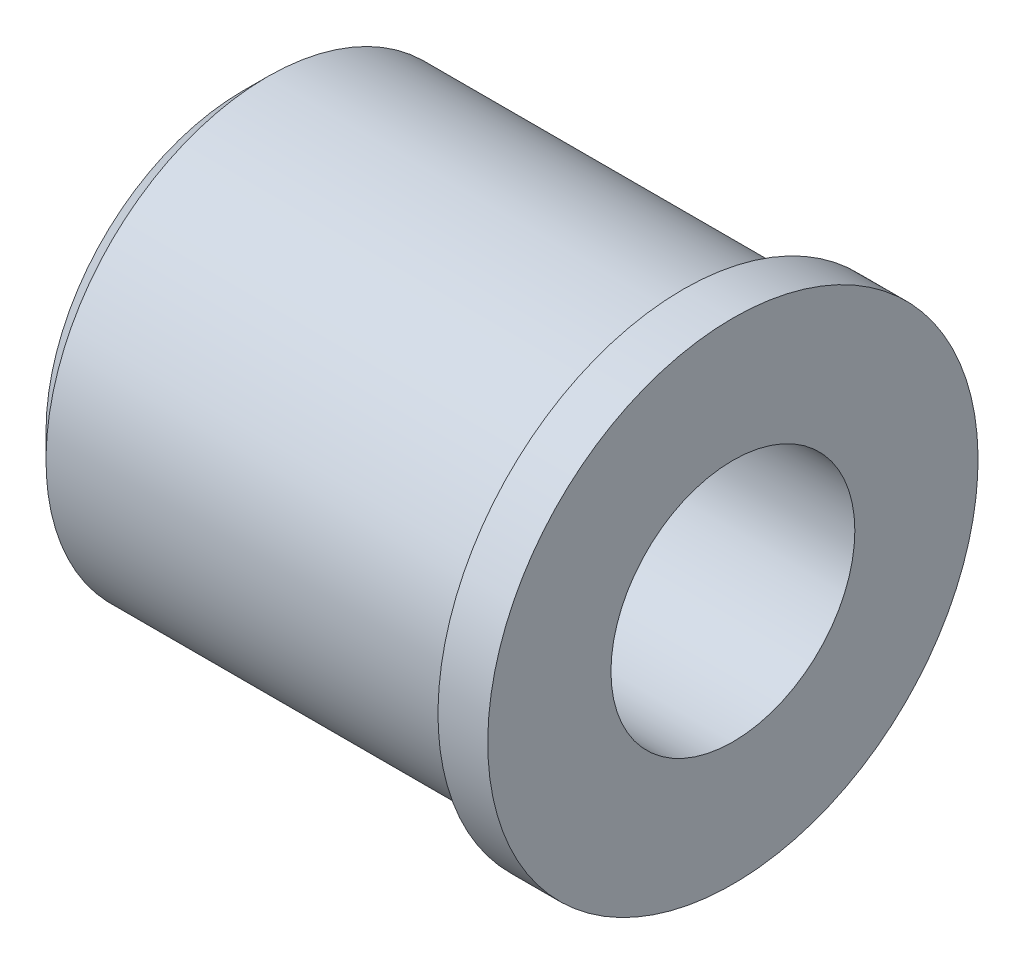
ISO-10303-21;
HEADER;
FILE_DESCRIPTION(('STEP AP214'),'2;1');
FILE_NAME('part.step','',(''),(''),'','','');
FILE_SCHEMA(('AUTOMOTIVE_DESIGN { 1 0 10303 214 1 1 1 1 }'));
ENDSEC;
DATA;
#1=APPLICATION_CONTEXT('core data for automotive mechanical design processes');
#2=APPLICATION_PROTOCOL_DEFINITION('international standard','automotive_design',2000,#1);
#3=PRODUCT_CONTEXT('',#1,'mechanical');
#4=PRODUCT('Part','Part','',(#3));
#5=PRODUCT_RELATED_PRODUCT_CATEGORY('part','',(#4));
#6=PRODUCT_DEFINITION_FORMATION('','',#4);
#7=PRODUCT_DEFINITION_CONTEXT('part definition',#1,'design');
#8=PRODUCT_DEFINITION('design','',#6,#7);
#9=PRODUCT_DEFINITION_SHAPE('','',#8);
#10=(LENGTH_UNIT() NAMED_UNIT(*) SI_UNIT(.MILLI.,.METRE.));
#11=(NAMED_UNIT(*) PLANE_ANGLE_UNIT() SI_UNIT($,.RADIAN.));
#12=(NAMED_UNIT(*) SI_UNIT($,.STERADIAN.) SOLID_ANGLE_UNIT());
#13=UNCERTAINTY_MEASURE_WITH_UNIT(LENGTH_MEASURE(1.E-05),#10,'distance_accuracy_value','');
#14=(GEOMETRIC_REPRESENTATION_CONTEXT(3) GLOBAL_UNCERTAINTY_ASSIGNED_CONTEXT((#13)) GLOBAL_UNIT_ASSIGNED_CONTEXT((#10,
#11,#12)) REPRESENTATION_CONTEXT('',''));
#15=CARTESIAN_POINT('',(0.,0.,0.));
#16=DIRECTION('',(0.,0.,1.));
#17=DIRECTION('',(1.,0.,0.));
#18=AXIS2_PLACEMENT_3D('',#15,#16,#17);
#19=CARTESIAN_POINT('',(0.,-5.64560135623729,0.));
#20=DIRECTION('',(-1.,0.,0.));
#21=DIRECTION('',(0.,-1.,0.));
#22=AXIS2_PLACEMENT_3D('',#19,#20,#21);
#23=PLANE('',#22);
#24=CARTESIAN_POINT('',(0.,0.,0.));
#25=DIRECTION('',(1.,0.,0.));
#26=DIRECTION('',(0.,0.,-1.));
#27=AXIS2_PLACEMENT_3D('',#24,#25,#26);
#28=CIRCLE('',#27,1.2446);
#29=CARTESIAN_POINT('',(0.,0.,-1.2446));
#30=VERTEX_POINT('',#29);
#31=EDGE_CURVE('E46',#30,#30,#28,.T.);
#32=ORIENTED_EDGE('',*,*,#31,.F.);
#33=EDGE_LOOP('',(#32));
#34=FACE_BOUND('',#33,.T.);
#35=CARTESIAN_POINT('',(0.,0.,0.));
#36=DIRECTION('',(1.,0.,0.));
#37=DIRECTION('',(0.,1.,0.));
#38=AXIS2_PLACEMENT_3D('',#35,#36,#37);
#39=CIRCLE('',#38,2.5019);
#40=CARTESIAN_POINT('',(0.,2.5019,0.));
#41=VERTEX_POINT('',#40);
#42=EDGE_CURVE('E10',#41,#41,#39,.T.);
#43=ORIENTED_EDGE('',*,*,#42,.T.);
#44=EDGE_LOOP('',(#43));
#45=FACE_BOUND('',#44,.T.);
#46=ADVANCED_FACE('F24',(#34,#45),#23,.F.);
#47=CARTESIAN_POINT('',(0.,0.,0.));
#48=DIRECTION('',(1.,0.,0.));
#49=DIRECTION('',(0.,1.,0.));
#50=AXIS2_PLACEMENT_3D('',#47,#48,#49);
#51=CYLINDRICAL_SURFACE('',#50,2.50190000000001);
#52=ORIENTED_EDGE('',*,*,#42,.F.);
#53=EDGE_LOOP('',(#52));
#54=FACE_BOUND('',#53,.T.);
#55=CARTESIAN_POINT('',(-0.507999999999994,0.,0.));
#56=DIRECTION('',(1.,0.,0.));
#57=DIRECTION('',(0.,1.,0.));
#58=AXIS2_PLACEMENT_3D('',#55,#56,#57);
#59=CIRCLE('',#58,2.50190000000002);
#60=CARTESIAN_POINT('',(-0.507999999999995,2.50190000000002,0.));
#61=VERTEX_POINT('',#60);
#62=EDGE_CURVE('E30',#61,#61,#59,.T.);
#63=ORIENTED_EDGE('',*,*,#62,.T.);
#64=EDGE_LOOP('',(#63));
#65=FACE_BOUND('',#64,.T.);
#66=ADVANCED_FACE('F63',(#54,#65),#51,.T.);
#67=CARTESIAN_POINT('',(-0.50799999999998,-5.64560135623729,0.));
#68=DIRECTION('',(-1.,0.,0.));
#69=DIRECTION('',(0.,-1.,0.));
#70=AXIS2_PLACEMENT_3D('',#67,#68,#69);
#71=PLANE('',#70);
#72=CARTESIAN_POINT('',(-0.507999999999969,0.,0.));
#73=DIRECTION('',(1.,0.,0.));
#74=DIRECTION('',(0.,1.,0.));
#75=AXIS2_PLACEMENT_3D('',#72,#73,#74);
#76=CIRCLE('',#75,2.26060000000002);
#77=CARTESIAN_POINT('',(-0.50799999999997,2.26060000000002,0.));
#78=VERTEX_POINT('',#77);
#79=EDGE_CURVE('E34',#78,#78,#76,.T.);
#80=ORIENTED_EDGE('',*,*,#79,.T.);
#81=EDGE_LOOP('',(#80));
#82=FACE_BOUND('',#81,.T.);
#83=ORIENTED_EDGE('',*,*,#62,.F.);
#84=EDGE_LOOP('',(#83));
#85=FACE_BOUND('',#84,.T.);
#86=ADVANCED_FACE('F69',(#82,#85),#71,.T.);
#87=CARTESIAN_POINT('',(0.,0.,0.));
#88=DIRECTION('',(1.,0.,0.));
#89=DIRECTION('',(0.,1.,0.));
#90=AXIS2_PLACEMENT_3D('',#87,#88,#89);
#91=CYLINDRICAL_SURFACE('',#90,2.26060000000002);
#92=CARTESIAN_POINT('',(-4.74979999999996,0.,0.));
#93=DIRECTION('',(1.,0.,0.));
#94=DIRECTION('',(0.,1.,0.));
#95=AXIS2_PLACEMENT_3D('',#92,#93,#94);
#96=CIRCLE('',#95,2.26060000000002);
#97=CARTESIAN_POINT('',(-4.74979999999996,2.26060000000002,0.));
#98=VERTEX_POINT('',#97);
#99=EDGE_CURVE('E38',#98,#98,#96,.T.);
#100=ORIENTED_EDGE('',*,*,#99,.T.);
#101=EDGE_LOOP('',(#100));
#102=FACE_BOUND('',#101,.T.);
#103=ORIENTED_EDGE('',*,*,#79,.F.);
#104=EDGE_LOOP('',(#103));
#105=FACE_BOUND('',#104,.T.);
#106=ADVANCED_FACE('F74',(#102,#105),#91,.T.);
#107=CARTESIAN_POINT('',(-5.00379999999996,0.,0.));
#108=DIRECTION('',(1.,0.,0.));
#109=DIRECTION('',(0.,1.,0.));
#110=AXIS2_PLACEMENT_3D('',#107,#108,#109);
#111=CONICAL_SURFACE('',#110,2.00660000000003,0.785398163397447);
#112=ORIENTED_EDGE('',*,*,#99,.F.);
#113=EDGE_LOOP('',(#112));
#114=FACE_BOUND('',#113,.T.);
#115=CARTESIAN_POINT('',(-5.00379999999996,0.,0.));
#116=DIRECTION('',(1.,0.,0.));
#117=DIRECTION('',(0.,1.,0.));
#118=AXIS2_PLACEMENT_3D('',#115,#116,#117);
#119=CIRCLE('',#118,2.00660000000003);
#120=CARTESIAN_POINT('',(-5.00379999999996,2.00660000000003,0.));
#121=VERTEX_POINT('',#120);
#122=EDGE_CURVE('E43',#121,#121,#119,.T.);
#123=ORIENTED_EDGE('',*,*,#122,.T.);
#124=EDGE_LOOP('',(#123));
#125=FACE_BOUND('',#124,.T.);
#126=ADVANCED_FACE('F80',(#114,#125),#111,.T.);
#127=CARTESIAN_POINT('',(-5.00379999999996,-5.64560135623729,0.));
#128=DIRECTION('',(-1.,0.,0.));
#129=DIRECTION('',(0.,-1.,0.));
#130=AXIS2_PLACEMENT_3D('',#127,#128,#129);
#131=PLANE('',#130);
#132=CARTESIAN_POINT('',(-5.00379999999996,0.,0.));
#133=DIRECTION('',(1.,0.,0.));
#134=DIRECTION('',(0.,0.,-1.));
#135=AXIS2_PLACEMENT_3D('',#132,#133,#134);
#136=CIRCLE('',#135,1.2446);
#137=CARTESIAN_POINT('',(-5.00379999999996,0.,-1.2446));
#138=VERTEX_POINT('',#137);
#139=EDGE_CURVE('E49',#138,#138,#136,.T.);
#140=ORIENTED_EDGE('',*,*,#139,.T.);
#141=EDGE_LOOP('',(#140));
#142=FACE_BOUND('',#141,.T.);
#143=ORIENTED_EDGE('',*,*,#122,.F.);
#144=EDGE_LOOP('',(#143));
#145=FACE_BOUND('',#144,.T.);
#146=ADVANCED_FACE('F53',(#142,#145),#131,.T.);
#147=CARTESIAN_POINT('',(0.,0.,0.));
#148=DIRECTION('',(1.,0.,0.));
#149=DIRECTION('',(0.,0.,-1.));
#150=AXIS2_PLACEMENT_3D('',#147,#148,#149);
#151=CYLINDRICAL_SURFACE('',#150,1.2446);
#152=ORIENTED_EDGE('',*,*,#139,.F.);
#153=EDGE_LOOP('',(#152));
#154=FACE_BOUND('',#153,.T.);
#155=ORIENTED_EDGE('',*,*,#31,.T.);
#156=EDGE_LOOP('',(#155));
#157=FACE_BOUND('',#156,.T.);
#158=ADVANCED_FACE('F56',(#154,#157),#151,.F.);
#159=CLOSED_SHELL('',(#46,#66,#86,#106,#126,#146,#158));
#160=MANIFOLD_SOLID_BREP('B2',#159);
#161=ADVANCED_BREP_SHAPE_REPRESENTATION('',(#18,#160),#14);
#162=SHAPE_DEFINITION_REPRESENTATION(#9,#161);
ENDSEC;
END-ISO-10303-21;
